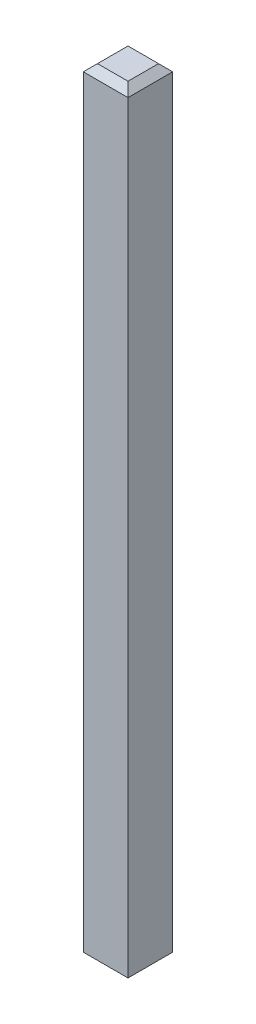
ISO-10303-21;
HEADER;
FILE_DESCRIPTION(('STEP AP214'),'2;1');
FILE_NAME('part.step','',(''),(''),'','','');
FILE_SCHEMA(('AUTOMOTIVE_DESIGN { 1 0 10303 214 1 1 1 1 }'));
ENDSEC;
DATA;
#1=APPLICATION_CONTEXT('core data for automotive mechanical design processes');
#2=APPLICATION_PROTOCOL_DEFINITION('international standard','automotive_design',2000,#1);
#3=PRODUCT_CONTEXT('',#1,'mechanical');
#4=PRODUCT('Part','Part','',(#3));
#5=PRODUCT_RELATED_PRODUCT_CATEGORY('part','',(#4));
#6=PRODUCT_DEFINITION_FORMATION('','',#4);
#7=PRODUCT_DEFINITION_CONTEXT('part definition',#1,'design');
#8=PRODUCT_DEFINITION('design','',#6,#7);
#9=PRODUCT_DEFINITION_SHAPE('','',#8);
#10=(LENGTH_UNIT() NAMED_UNIT(*) SI_UNIT(.MILLI.,.METRE.));
#11=(NAMED_UNIT(*) PLANE_ANGLE_UNIT() SI_UNIT($,.RADIAN.));
#12=(NAMED_UNIT(*) SI_UNIT($,.STERADIAN.) SOLID_ANGLE_UNIT());
#13=UNCERTAINTY_MEASURE_WITH_UNIT(LENGTH_MEASURE(1.E-05),#10,'distance_accuracy_value','');
#14=(GEOMETRIC_REPRESENTATION_CONTEXT(3) GLOBAL_UNCERTAINTY_ASSIGNED_CONTEXT((#13)) GLOBAL_UNIT_ASSIGNED_CONTEXT((#10,
#11,#12)) REPRESENTATION_CONTEXT('',''));
#15=CARTESIAN_POINT('',(0.,0.,0.));
#16=DIRECTION('',(0.,0.,1.));
#17=DIRECTION('',(1.,0.,0.));
#18=AXIS2_PLACEMENT_3D('',#15,#16,#17);
#19=CARTESIAN_POINT('',(0.,10.95,0.215));
#20=DIRECTION('',(0.,0.707106781186545,0.707106781186551));
#21=DIRECTION('',(1.,0.,0.));
#22=AXIS2_PLACEMENT_3D('',#19,#20,#21);
#23=PLANE('',#22);
#24=DIRECTION('',(-0.577350269189624,-0.577350269189629,0.577350269189624));
#25=VECTOR('',#24,1.);
#26=CARTESIAN_POINT('',(-0.143333333333333,11.0216666666667,0.143333333333334));
#27=LINE('',#26,#25);
#28=CARTESIAN_POINT('',(-0.215,10.95,0.215));
#29=VERTEX_POINT('',#28);
#30=CARTESIAN_POINT('',(-0.315,10.85,0.315));
#31=VERTEX_POINT('',#30);
#32=EDGE_CURVE('E26',#29,#31,#27,.T.);
#33=ORIENTED_EDGE('',*,*,#32,.T.);
#34=DIRECTION('',(-1.,0.,0.));
#35=VECTOR('',#34,1.);
#36=CARTESIAN_POINT('',(-0.315,10.85,0.315));
#37=LINE('',#36,#35);
#38=CARTESIAN_POINT('',(0.315,10.85,0.315));
#39=VERTEX_POINT('',#38);
#40=EDGE_CURVE('E141',#39,#31,#37,.T.);
#41=ORIENTED_EDGE('',*,*,#40,.F.);
#42=DIRECTION('',(-0.577350269189624,0.577350269189629,-0.577350269189624));
#43=VECTOR('',#42,1.);
#44=CARTESIAN_POINT('',(0.143333333333334,11.0216666666667,0.143333333333334));
#45=LINE('',#44,#43);
#46=CARTESIAN_POINT('',(0.215,10.95,0.215));
#47=VERTEX_POINT('',#46);
#48=EDGE_CURVE('E11',#39,#47,#45,.T.);
#49=ORIENTED_EDGE('',*,*,#48,.T.);
#50=DIRECTION('',(1.,0.,0.));
#51=VECTOR('',#50,1.);
#52=CARTESIAN_POINT('',(0.315,10.95,0.215));
#53=LINE('',#52,#51);
#54=EDGE_CURVE('E177',#29,#47,#53,.T.);
#55=ORIENTED_EDGE('',*,*,#54,.F.);
#56=EDGE_LOOP('',(#33,#41,#49,#55));
#57=FACE_BOUND('',#56,.T.);
#58=ADVANCED_FACE('F17',(#57),#23,.T.);
#59=CARTESIAN_POINT('',(0.215,10.95,0.));
#60=DIRECTION('',(0.707106781186551,0.707106781186545,0.));
#61=DIRECTION('',(0.,0.,-1.));
#62=AXIS2_PLACEMENT_3D('',#59,#60,#61);
#63=PLANE('',#62);
#64=DIRECTION('',(-0.577350269189624,0.577350269189629,0.577350269189624));
#65=VECTOR('',#64,1.);
#66=CARTESIAN_POINT('',(0.143333333333334,11.0216666666667,-0.143333333333334));
#67=LINE('',#66,#65);
#68=CARTESIAN_POINT('',(0.315,10.85,-0.315));
#69=VERTEX_POINT('',#68);
#70=CARTESIAN_POINT('',(0.215,10.95,-0.215));
#71=VERTEX_POINT('',#70);
#72=EDGE_CURVE('E86',#69,#71,#67,.T.);
#73=ORIENTED_EDGE('',*,*,#72,.T.);
#74=DIRECTION('',(0.,0.,-1.));
#75=VECTOR('',#74,1.);
#76=CARTESIAN_POINT('',(0.215,10.95,-0.315));
#77=LINE('',#76,#75);
#78=EDGE_CURVE('E181',#47,#71,#77,.T.);
#79=ORIENTED_EDGE('',*,*,#78,.F.);
#80=ORIENTED_EDGE('',*,*,#48,.F.);
#81=DIRECTION('',(0.,0.,1.));
#82=VECTOR('',#81,1.);
#83=CARTESIAN_POINT('',(0.315,10.85,0.315));
#84=LINE('',#83,#82);
#85=EDGE_CURVE('E227',#69,#39,#84,.T.);
#86=ORIENTED_EDGE('',*,*,#85,.F.);
#87=EDGE_LOOP('',(#73,#79,#80,#86));
#88=FACE_BOUND('',#87,.T.);
#89=ADVANCED_FACE('F19',(#88),#63,.T.);
#90=CARTESIAN_POINT('',(-0.215,10.95,0.));
#91=DIRECTION('',(-0.707106781186551,0.707106781186545,0.));
#92=DIRECTION('',(0.,0.,1.));
#93=AXIS2_PLACEMENT_3D('',#90,#91,#92);
#94=PLANE('',#93);
#95=DIRECTION('',(-0.577350269189624,-0.577350269189629,-0.577350269189624));
#96=VECTOR('',#95,1.);
#97=CARTESIAN_POINT('',(-0.143333333333333,11.0216666666667,-0.143333333333334));
#98=LINE('',#97,#96);
#99=CARTESIAN_POINT('',(-0.215,10.95,-0.215));
#100=VERTEX_POINT('',#99);
#101=CARTESIAN_POINT('',(-0.315,10.85,-0.315));
#102=VERTEX_POINT('',#101);
#103=EDGE_CURVE('E118',#100,#102,#98,.T.);
#104=ORIENTED_EDGE('',*,*,#103,.T.);
#105=DIRECTION('',(0.,0.,-1.));
#106=VECTOR('',#105,1.);
#107=CARTESIAN_POINT('',(-0.315,10.85,-0.315));
#108=LINE('',#107,#106);
#109=EDGE_CURVE('E142',#31,#102,#108,.T.);
#110=ORIENTED_EDGE('',*,*,#109,.F.);
#111=ORIENTED_EDGE('',*,*,#32,.F.);
#112=DIRECTION('',(0.,0.,1.));
#113=VECTOR('',#112,1.);
#114=CARTESIAN_POINT('',(-0.215,10.95,0.315));
#115=LINE('',#114,#113);
#116=EDGE_CURVE('E173',#100,#29,#115,.T.);
#117=ORIENTED_EDGE('',*,*,#116,.F.);
#118=EDGE_LOOP('',(#104,#110,#111,#117));
#119=FACE_BOUND('',#118,.T.);
#120=ADVANCED_FACE('F213',(#119),#94,.T.);
#121=CARTESIAN_POINT('',(0.,10.95,-0.215));
#122=DIRECTION('',(0.,0.707106781186545,-0.707106781186551));
#123=DIRECTION('',(-1.,0.,0.));
#124=AXIS2_PLACEMENT_3D('',#121,#122,#123);
#125=PLANE('',#124);
#126=ORIENTED_EDGE('',*,*,#72,.F.);
#127=DIRECTION('',(1.,0.,0.));
#128=VECTOR('',#127,1.);
#129=CARTESIAN_POINT('',(0.315,10.85,-0.315));
#130=LINE('',#129,#128);
#131=EDGE_CURVE('E157',#102,#69,#130,.T.);
#132=ORIENTED_EDGE('',*,*,#131,.F.);
#133=ORIENTED_EDGE('',*,*,#103,.F.);
#134=DIRECTION('',(-1.,0.,0.));
#135=VECTOR('',#134,1.);
#136=CARTESIAN_POINT('',(-0.315,10.95,-0.215));
#137=LINE('',#136,#135);
#138=EDGE_CURVE('E167',#71,#100,#137,.T.);
#139=ORIENTED_EDGE('',*,*,#138,.F.);
#140=EDGE_LOOP('',(#126,#132,#133,#139));
#141=FACE_BOUND('',#140,.T.);
#142=ADVANCED_FACE('F216',(#141),#125,.T.);
#143=CARTESIAN_POINT('',(-0.315,0.1,-0.315));
#144=DIRECTION('',(0.,0.707106781186542,0.707106781186554));
#145=DIRECTION('',(1.,0.,0.));
#146=AXIS2_PLACEMENT_3D('',#143,#144,#145);
#147=PLANE('',#146);
#148=DIRECTION('',(-0.577350269189622,-0.577350269189633,0.577350269189623));
#149=VECTOR('',#148,1.);
#150=CARTESIAN_POINT('',(0.315,0.1,-0.315));
#151=LINE('',#150,#149);
#152=CARTESIAN_POINT('',(0.315,0.1,-0.315));
#153=VERTEX_POINT('',#152);
#154=CARTESIAN_POINT('',(0.215,0.,-0.215));
#155=VERTEX_POINT('',#154);
#156=EDGE_CURVE('E53',#153,#155,#151,.T.);
#157=ORIENTED_EDGE('',*,*,#156,.T.);
#158=DIRECTION('',(1.,0.,0.));
#159=VECTOR('',#158,1.);
#160=CARTESIAN_POINT('',(0.,0.,-0.215));
#161=LINE('',#160,#159);
#162=CARTESIAN_POINT('',(-0.215,0.,-0.215));
#163=VERTEX_POINT('',#162);
#164=EDGE_CURVE('E187',#163,#155,#161,.T.);
#165=ORIENTED_EDGE('',*,*,#164,.F.);
#166=DIRECTION('',(-0.577350269189622,0.577350269189632,-0.577350269189622));
#167=VECTOR('',#166,1.);
#168=CARTESIAN_POINT('',(-0.315,0.1,-0.315));
#169=LINE('',#168,#167);
#170=CARTESIAN_POINT('',(-0.315,0.1,-0.315));
#171=VERTEX_POINT('',#170);
#172=EDGE_CURVE('E201',#163,#171,#169,.T.);
#173=ORIENTED_EDGE('',*,*,#172,.T.);
#174=DIRECTION('',(-1.,0.,0.));
#175=VECTOR('',#174,1.);
#176=CARTESIAN_POINT('',(-0.315,0.1,-0.315));
#177=LINE('',#176,#175);
#178=EDGE_CURVE('E221',#153,#171,#177,.T.);
#179=ORIENTED_EDGE('',*,*,#178,.F.);
#180=EDGE_LOOP('',(#157,#165,#173,#179));
#181=FACE_BOUND('',#180,.T.);
#182=ADVANCED_FACE('F390',(#181),#147,.F.);
#183=CARTESIAN_POINT('',(-0.315,0.1,-0.315));
#184=DIRECTION('',(0.707106781186554,0.707106781186542,0.));
#185=DIRECTION('',(0.,0.,-1.));
#186=AXIS2_PLACEMENT_3D('',#183,#184,#185);
#187=PLANE('',#186);
#188=DIRECTION('',(-0.577350269189622,0.577350269189633,0.577350269189623));
#189=VECTOR('',#188,1.);
#190=CARTESIAN_POINT('',(-0.315,0.1,0.315));
#191=LINE('',#190,#189);
#192=CARTESIAN_POINT('',(-0.215,0.,0.215));
#193=VERTEX_POINT('',#192);
#194=CARTESIAN_POINT('',(-0.315,0.1,0.315));
#195=VERTEX_POINT('',#194);
#196=EDGE_CURVE('E72',#193,#195,#191,.T.);
#197=ORIENTED_EDGE('',*,*,#196,.T.);
#198=DIRECTION('',(0.,0.,1.));
#199=VECTOR('',#198,1.);
#200=CARTESIAN_POINT('',(-0.315,0.1,-0.315));
#201=LINE('',#200,#199);
#202=EDGE_CURVE('E127',#171,#195,#201,.T.);
#203=ORIENTED_EDGE('',*,*,#202,.F.);
#204=ORIENTED_EDGE('',*,*,#172,.F.);
#205=DIRECTION('',(0.,0.,-1.));
#206=VECTOR('',#205,1.);
#207=CARTESIAN_POINT('',(-0.215,0.,0.));
#208=LINE('',#207,#206);
#209=EDGE_CURVE('E130',#193,#163,#208,.T.);
#210=ORIENTED_EDGE('',*,*,#209,.F.);
#211=EDGE_LOOP('',(#197,#203,#204,#210));
#212=FACE_BOUND('',#211,.T.);
#213=ADVANCED_FACE('F125',(#212),#187,.F.);
#214=CARTESIAN_POINT('',(0.315,0.1,-0.315));
#215=DIRECTION('',(-0.707106781186554,0.707106781186542,0.));
#216=DIRECTION('',(0.,0.,1.));
#217=AXIS2_PLACEMENT_3D('',#214,#215,#216);
#218=PLANE('',#217);
#219=DIRECTION('',(-0.577350269189622,-0.577350269189632,-0.577350269189622));
#220=VECTOR('',#219,1.);
#221=CARTESIAN_POINT('',(0.105000000000002,-0.11,0.105000000000002));
#222=LINE('',#221,#220);
#223=CARTESIAN_POINT('',(0.315,0.1,0.315));
#224=VERTEX_POINT('',#223);
#225=CARTESIAN_POINT('',(0.215,0.,0.215));
#226=VERTEX_POINT('',#225);
#227=EDGE_CURVE('E39',#224,#226,#222,.T.);
#228=ORIENTED_EDGE('',*,*,#227,.T.);
#229=DIRECTION('',(0.,0.,1.));
#230=VECTOR('',#229,1.);
#231=CARTESIAN_POINT('',(0.215,0.,0.));
#232=LINE('',#231,#230);
#233=EDGE_CURVE('E191',#155,#226,#232,.T.);
#234=ORIENTED_EDGE('',*,*,#233,.F.);
#235=ORIENTED_EDGE('',*,*,#156,.F.);
#236=DIRECTION('',(0.,0.,-1.));
#237=VECTOR('',#236,1.);
#238=CARTESIAN_POINT('',(0.315,0.1,-0.315));
#239=LINE('',#238,#237);
#240=EDGE_CURVE('E232',#224,#153,#239,.T.);
#241=ORIENTED_EDGE('',*,*,#240,.F.);
#242=EDGE_LOOP('',(#228,#234,#235,#241));
#243=FACE_BOUND('',#242,.T.);
#244=ADVANCED_FACE('F435',(#243),#218,.F.);
#245=CARTESIAN_POINT('',(-0.315,0.1,0.315));
#246=DIRECTION('',(0.,0.707106781186542,-0.707106781186554));
#247=DIRECTION('',(-1.,0.,0.));
#248=AXIS2_PLACEMENT_3D('',#245,#246,#247);
#249=PLANE('',#248);
#250=ORIENTED_EDGE('',*,*,#196,.F.);
#251=DIRECTION('',(-1.,0.,0.));
#252=VECTOR('',#251,1.);
#253=CARTESIAN_POINT('',(0.,0.,0.215));
#254=LINE('',#253,#252);
#255=EDGE_CURVE('E132',#226,#193,#254,.T.);
#256=ORIENTED_EDGE('',*,*,#255,.F.);
#257=ORIENTED_EDGE('',*,*,#227,.F.);
#258=DIRECTION('',(1.,0.,0.));
#259=VECTOR('',#258,1.);
#260=CARTESIAN_POINT('',(-0.315,0.1,0.315));
#261=LINE('',#260,#259);
#262=EDGE_CURVE('E135',#195,#224,#261,.T.);
#263=ORIENTED_EDGE('',*,*,#262,.F.);
#264=EDGE_LOOP('',(#250,#256,#257,#263));
#265=FACE_BOUND('',#264,.T.);
#266=ADVANCED_FACE('F137',(#265),#249,.F.);
#267=CARTESIAN_POINT('',(0.,0.,0.));
#268=DIRECTION('',(0.,1.,0.));
#269=DIRECTION('',(1.,0.,0.));
#270=AXIS2_PLACEMENT_3D('',#267,#268,#269);
#271=PLANE('',#270);
#272=ORIENTED_EDGE('',*,*,#209,.T.);
#273=ORIENTED_EDGE('',*,*,#164,.T.);
#274=ORIENTED_EDGE('',*,*,#233,.T.);
#275=ORIENTED_EDGE('',*,*,#255,.T.);
#276=EDGE_LOOP('',(#272,#273,#274,#275));
#277=FACE_BOUND('',#276,.T.);
#278=ADVANCED_FACE('F412',(#277),#271,.F.);
#279=CARTESIAN_POINT('',(0.,10.95,0.));
#280=DIRECTION('',(0.,1.,0.));
#281=DIRECTION('',(1.,0.,0.));
#282=AXIS2_PLACEMENT_3D('',#279,#280,#281);
#283=PLANE('',#282);
#284=ORIENTED_EDGE('',*,*,#116,.T.);
#285=ORIENTED_EDGE('',*,*,#54,.T.);
#286=ORIENTED_EDGE('',*,*,#78,.T.);
#287=ORIENTED_EDGE('',*,*,#138,.T.);
#288=EDGE_LOOP('',(#284,#285,#286,#287));
#289=FACE_BOUND('',#288,.T.);
#290=ADVANCED_FACE('F251',(#289),#283,.T.);
#291=CARTESIAN_POINT('',(-0.315,10.95,0.315));
#292=DIRECTION('',(0.,0.,-1.));
#293=DIRECTION('',(0.,-1.,0.));
#294=AXIS2_PLACEMENT_3D('',#291,#292,#293);
#295=PLANE('',#294);
#296=DIRECTION('',(0.,-1.,0.));
#297=VECTOR('',#296,1.);
#298=CARTESIAN_POINT('',(-0.315,10.95,0.315));
#299=LINE('',#298,#297);
#300=EDGE_CURVE('E146',#31,#195,#299,.T.);
#301=ORIENTED_EDGE('',*,*,#300,.T.);
#302=ORIENTED_EDGE('',*,*,#262,.T.);
#303=DIRECTION('',(0.,-1.,0.));
#304=VECTOR('',#303,1.);
#305=CARTESIAN_POINT('',(0.315,10.95,0.315));
#306=LINE('',#305,#304);
#307=EDGE_CURVE('E236',#39,#224,#306,.T.);
#308=ORIENTED_EDGE('',*,*,#307,.F.);
#309=ORIENTED_EDGE('',*,*,#40,.T.);
#310=EDGE_LOOP('',(#301,#302,#308,#309));
#311=FACE_BOUND('',#310,.T.);
#312=ADVANCED_FACE('F147',(#311),#295,.F.);
#313=CARTESIAN_POINT('',(-0.315,10.95,-0.315));
#314=DIRECTION('',(1.,0.,0.));
#315=DIRECTION('',(0.,0.,-1.));
#316=AXIS2_PLACEMENT_3D('',#313,#314,#315);
#317=PLANE('',#316);
#318=DIRECTION('',(0.,-1.,0.));
#319=VECTOR('',#318,1.);
#320=CARTESIAN_POINT('',(-0.315,10.95,-0.315));
#321=LINE('',#320,#319);
#322=EDGE_CURVE('E154',#102,#171,#321,.T.);
#323=ORIENTED_EDGE('',*,*,#322,.T.);
#324=ORIENTED_EDGE('',*,*,#202,.T.);
#325=ORIENTED_EDGE('',*,*,#300,.F.);
#326=ORIENTED_EDGE('',*,*,#109,.T.);
#327=EDGE_LOOP('',(#323,#324,#325,#326));
#328=FACE_BOUND('',#327,.T.);
#329=ADVANCED_FACE('F152',(#328),#317,.F.);
#330=CARTESIAN_POINT('',(-0.315,10.95,-0.315));
#331=DIRECTION('',(0.,0.,1.));
#332=DIRECTION('',(1.,0.,0.));
#333=AXIS2_PLACEMENT_3D('',#330,#331,#332);
#334=PLANE('',#333);
#335=DIRECTION('',(0.,-1.,0.));
#336=VECTOR('',#335,1.);
#337=CARTESIAN_POINT('',(0.315,10.95,-0.315));
#338=LINE('',#337,#336);
#339=EDGE_CURVE('E230',#69,#153,#338,.T.);
#340=ORIENTED_EDGE('',*,*,#339,.T.);
#341=ORIENTED_EDGE('',*,*,#178,.T.);
#342=ORIENTED_EDGE('',*,*,#322,.F.);
#343=ORIENTED_EDGE('',*,*,#131,.T.);
#344=EDGE_LOOP('',(#340,#341,#342,#343));
#345=FACE_BOUND('',#344,.T.);
#346=ADVANCED_FACE('F220',(#345),#334,.F.);
#347=CARTESIAN_POINT('',(0.315,10.95,-0.315));
#348=DIRECTION('',(-1.,0.,0.));
#349=DIRECTION('',(0.,1.,0.));
#350=AXIS2_PLACEMENT_3D('',#347,#348,#349);
#351=PLANE('',#350);
#352=ORIENTED_EDGE('',*,*,#307,.T.);
#353=ORIENTED_EDGE('',*,*,#240,.T.);
#354=ORIENTED_EDGE('',*,*,#339,.F.);
#355=ORIENTED_EDGE('',*,*,#85,.T.);
#356=EDGE_LOOP('',(#352,#353,#354,#355));
#357=FACE_BOUND('',#356,.T.);
#358=ADVANCED_FACE('F244',(#357),#351,.F.);
#359=CLOSED_SHELL('',(#58,#89,#120,#142,#182,#213,#244,#266,#278,#290,#312,#329,#346,#358));
#360=MANIFOLD_SOLID_BREP('B1',#359);
#361=ADVANCED_BREP_SHAPE_REPRESENTATION('',(#18,#360),#14);
#362=SHAPE_DEFINITION_REPRESENTATION(#9,#361);
ENDSEC;
END-ISO-10303-21;
